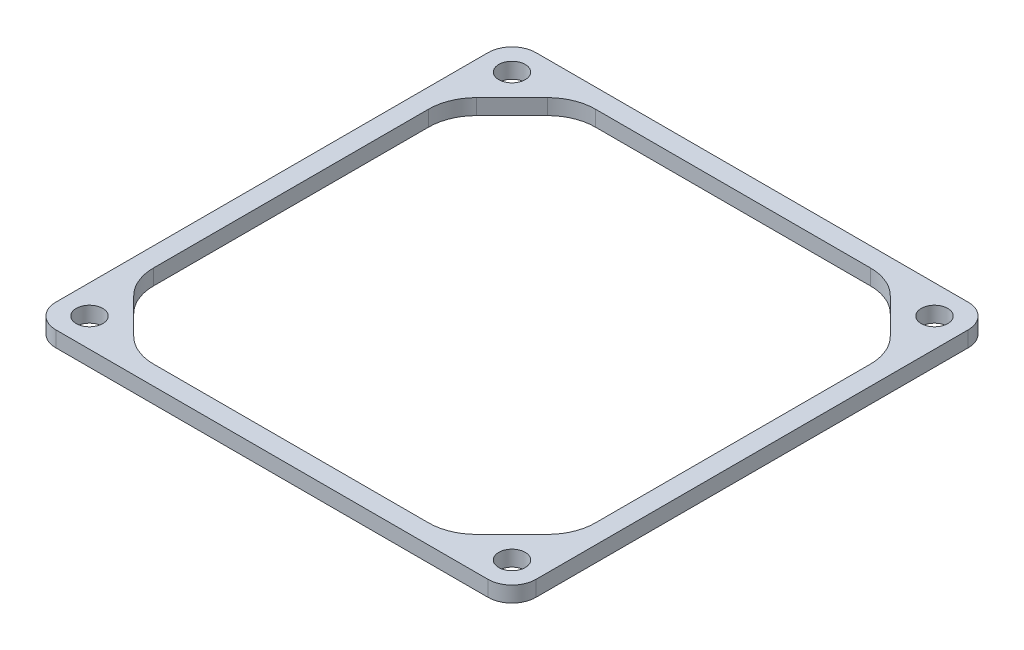
ISO-10303-21;
HEADER;
FILE_DESCRIPTION(('STEP AP214'),'2;1');
FILE_NAME('part.step','',(''),(''),'','','');
FILE_SCHEMA(('AUTOMOTIVE_DESIGN { 1 0 10303 214 1 1 1 1 }'));
ENDSEC;
DATA;
#1=APPLICATION_CONTEXT('core data for automotive mechanical design processes');
#2=APPLICATION_PROTOCOL_DEFINITION('international standard','automotive_design',2000,#1);
#3=PRODUCT_CONTEXT('',#1,'mechanical');
#4=PRODUCT('Part','Part','',(#3));
#5=PRODUCT_RELATED_PRODUCT_CATEGORY('part','',(#4));
#6=PRODUCT_DEFINITION_FORMATION('','',#4);
#7=PRODUCT_DEFINITION_CONTEXT('part definition',#1,'design');
#8=PRODUCT_DEFINITION('design','',#6,#7);
#9=PRODUCT_DEFINITION_SHAPE('','',#8);
#10=(LENGTH_UNIT() NAMED_UNIT(*) SI_UNIT(.MILLI.,.METRE.));
#11=(NAMED_UNIT(*) PLANE_ANGLE_UNIT() SI_UNIT($,.RADIAN.));
#12=(NAMED_UNIT(*) SI_UNIT($,.STERADIAN.) SOLID_ANGLE_UNIT());
#13=UNCERTAINTY_MEASURE_WITH_UNIT(LENGTH_MEASURE(1.E-05),#10,'distance_accuracy_value','');
#14=(GEOMETRIC_REPRESENTATION_CONTEXT(3) GLOBAL_UNCERTAINTY_ASSIGNED_CONTEXT((#13)) GLOBAL_UNIT_ASSIGNED_CONTEXT((#10,
#11,#12)) REPRESENTATION_CONTEXT('',''));
#15=CARTESIAN_POINT('',(0.,0.,0.));
#16=DIRECTION('',(0.,0.,1.));
#17=DIRECTION('',(1.,0.,0.));
#18=AXIS2_PLACEMENT_3D('',#15,#16,#17);
#19=CARTESIAN_POINT('',(-57.15,3.175,57.15));
#20=DIRECTION('',(0.,-1.,0.));
#21=DIRECTION('',(0.,0.,-1.));
#22=AXIS2_PLACEMENT_3D('',#19,#20,#21);
#23=CYLINDRICAL_SURFACE('',#22,6.35);
#24=CARTESIAN_POINT('',(-57.15,24.4475,57.15));
#25=DIRECTION('',(0.,-1.,0.));
#26=DIRECTION('',(0.,0.,-1.));
#27=AXIS2_PLACEMENT_3D('',#24,#25,#26);
#28=CIRCLE('',#27,6.35);
#29=CARTESIAN_POINT('',(-57.15,24.4475,63.5));
#30=VERTEX_POINT('',#29);
#31=CARTESIAN_POINT('',(-63.5,24.4475,57.15));
#32=VERTEX_POINT('',#31);
#33=EDGE_CURVE('E50',#30,#32,#28,.T.);
#34=ORIENTED_EDGE('',*,*,#33,.F.);
#35=DIRECTION('',(0.,-1.,0.));
#36=VECTOR('',#35,1.);
#37=CARTESIAN_POINT('',(-57.15,3.175,63.5));
#38=LINE('',#37,#36);
#39=CARTESIAN_POINT('',(-57.15,28.575,63.5));
#40=VERTEX_POINT('',#39);
#41=EDGE_CURVE('E11',#40,#30,#38,.T.);
#42=ORIENTED_EDGE('',*,*,#41,.F.);
#43=CARTESIAN_POINT('',(-57.15,28.575,57.15));
#44=DIRECTION('',(0.,1.,0.));
#45=DIRECTION('',(0.,0.,1.));
#46=AXIS2_PLACEMENT_3D('',#43,#44,#45);
#47=CIRCLE('',#46,6.35);
#48=CARTESIAN_POINT('',(-63.5,28.575,57.15));
#49=VERTEX_POINT('',#48);
#50=EDGE_CURVE('E264',#49,#40,#47,.T.);
#51=ORIENTED_EDGE('',*,*,#50,.F.);
#52=DIRECTION('',(0.,-1.,0.));
#53=VECTOR('',#52,1.);
#54=CARTESIAN_POINT('',(-63.5,3.175,57.15));
#55=LINE('',#54,#53);
#56=EDGE_CURVE('E288',#49,#32,#55,.T.);
#57=ORIENTED_EDGE('',*,*,#56,.T.);
#58=EDGE_LOOP('',(#34,#42,#51,#57));
#59=FACE_BOUND('',#58,.T.);
#60=ADVANCED_FACE('F35',(#59),#23,.T.);
#61=CARTESIAN_POINT('',(-57.15,3.175,63.5));
#62=DIRECTION('',(0.,0.,-1.));
#63=DIRECTION('',(-1.,0.,0.));
#64=AXIS2_PLACEMENT_3D('',#61,#62,#63);
#65=PLANE('',#64);
#66=DIRECTION('',(-1.,0.,0.));
#67=VECTOR('',#66,1.);
#68=CARTESIAN_POINT('',(-57.15,24.4475,63.5));
#69=LINE('',#68,#67);
#70=CARTESIAN_POINT('',(57.15,24.4475,63.5));
#71=VERTEX_POINT('',#70);
#72=EDGE_CURVE('E316',#71,#30,#69,.T.);
#73=ORIENTED_EDGE('',*,*,#72,.F.);
#74=DIRECTION('',(0.,-1.,0.));
#75=VECTOR('',#74,1.);
#76=CARTESIAN_POINT('',(57.15,3.175,63.5));
#77=LINE('',#76,#75);
#78=CARTESIAN_POINT('',(57.15,28.575,63.5));
#79=VERTEX_POINT('',#78);
#80=EDGE_CURVE('E43',#79,#71,#77,.T.);
#81=ORIENTED_EDGE('',*,*,#80,.F.);
#82=DIRECTION('',(1.,0.,0.));
#83=VECTOR('',#82,1.);
#84=CARTESIAN_POINT('',(-57.15,28.575,63.5));
#85=LINE('',#84,#83);
#86=EDGE_CURVE('E267',#40,#79,#85,.T.);
#87=ORIENTED_EDGE('',*,*,#86,.F.);
#88=ORIENTED_EDGE('',*,*,#41,.T.);
#89=EDGE_LOOP('',(#73,#81,#87,#88));
#90=FACE_BOUND('',#89,.T.);
#91=ADVANCED_FACE('F315',(#90),#65,.F.);
#92=CARTESIAN_POINT('',(57.15,3.175,57.15));
#93=DIRECTION('',(0.,-1.,0.));
#94=DIRECTION('',(0.,0.,-1.));
#95=AXIS2_PLACEMENT_3D('',#92,#93,#94);
#96=CYLINDRICAL_SURFACE('',#95,6.35);
#97=CARTESIAN_POINT('',(57.15,24.4475,57.15));
#98=DIRECTION('',(0.,-1.,0.));
#99=DIRECTION('',(0.,0.,-1.));
#100=AXIS2_PLACEMENT_3D('',#97,#98,#99);
#101=CIRCLE('',#100,6.35);
#102=CARTESIAN_POINT('',(63.5,24.4475,57.15));
#103=VERTEX_POINT('',#102);
#104=EDGE_CURVE('E311',#103,#71,#101,.T.);
#105=ORIENTED_EDGE('',*,*,#104,.F.);
#106=DIRECTION('',(0.,-1.,0.));
#107=VECTOR('',#106,1.);
#108=CARTESIAN_POINT('',(63.5,3.175,57.15));
#109=LINE('',#108,#107);
#110=CARTESIAN_POINT('',(63.5,28.575,57.15));
#111=VERTEX_POINT('',#110);
#112=EDGE_CURVE('E303',#111,#103,#109,.T.);
#113=ORIENTED_EDGE('',*,*,#112,.F.);
#114=CARTESIAN_POINT('',(57.15,28.575,57.15));
#115=DIRECTION('',(0.,1.,0.));
#116=DIRECTION('',(0.,0.,1.));
#117=AXIS2_PLACEMENT_3D('',#114,#115,#116);
#118=CIRCLE('',#117,6.35);
#119=EDGE_CURVE('E270',#79,#111,#118,.T.);
#120=ORIENTED_EDGE('',*,*,#119,.F.);
#121=ORIENTED_EDGE('',*,*,#80,.T.);
#122=EDGE_LOOP('',(#105,#113,#120,#121));
#123=FACE_BOUND('',#122,.T.);
#124=ADVANCED_FACE('F310',(#123),#96,.T.);
#125=CARTESIAN_POINT('',(63.5,3.175,-57.15));
#126=DIRECTION('',(-1.,0.,0.));
#127=DIRECTION('',(0.,0.,1.));
#128=AXIS2_PLACEMENT_3D('',#125,#126,#127);
#129=PLANE('',#128);
#130=DIRECTION('',(0.,0.,1.));
#131=VECTOR('',#130,1.);
#132=CARTESIAN_POINT('',(63.5,24.4475,-57.15));
#133=LINE('',#132,#131);
#134=CARTESIAN_POINT('',(63.5,24.4475,-57.15));
#135=VERTEX_POINT('',#134);
#136=EDGE_CURVE('E392',#135,#103,#133,.T.);
#137=ORIENTED_EDGE('',*,*,#136,.F.);
#138=DIRECTION('',(0.,-1.,0.));
#139=VECTOR('',#138,1.);
#140=CARTESIAN_POINT('',(63.5,3.175,-57.15));
#141=LINE('',#140,#139);
#142=CARTESIAN_POINT('',(63.5,28.575,-57.15));
#143=VERTEX_POINT('',#142);
#144=EDGE_CURVE('E300',#143,#135,#141,.T.);
#145=ORIENTED_EDGE('',*,*,#144,.F.);
#146=DIRECTION('',(0.,0.,-1.));
#147=VECTOR('',#146,1.);
#148=CARTESIAN_POINT('',(63.5,28.575,57.15));
#149=LINE('',#148,#147);
#150=EDGE_CURVE('E273',#111,#143,#149,.T.);
#151=ORIENTED_EDGE('',*,*,#150,.F.);
#152=ORIENTED_EDGE('',*,*,#112,.T.);
#153=EDGE_LOOP('',(#137,#145,#151,#152));
#154=FACE_BOUND('',#153,.T.);
#155=ADVANCED_FACE('F396',(#154),#129,.F.);
#156=CARTESIAN_POINT('',(57.15,3.175,-57.15));
#157=DIRECTION('',(0.,-1.,0.));
#158=DIRECTION('',(0.,0.,-1.));
#159=AXIS2_PLACEMENT_3D('',#156,#157,#158);
#160=CYLINDRICAL_SURFACE('',#159,6.35);
#161=CARTESIAN_POINT('',(57.15,24.4475,-57.15));
#162=DIRECTION('',(0.,-1.,0.));
#163=DIRECTION('',(0.,0.,-1.));
#164=AXIS2_PLACEMENT_3D('',#161,#162,#163);
#165=CIRCLE('',#164,6.35);
#166=CARTESIAN_POINT('',(57.15,24.4475,-63.5));
#167=VERTEX_POINT('',#166);
#168=EDGE_CURVE('E390',#167,#135,#165,.T.);
#169=ORIENTED_EDGE('',*,*,#168,.F.);
#170=DIRECTION('',(0.,-1.,0.));
#171=VECTOR('',#170,1.);
#172=CARTESIAN_POINT('',(57.15,3.175,-63.5));
#173=LINE('',#172,#171);
#174=CARTESIAN_POINT('',(57.15,28.575,-63.5));
#175=VERTEX_POINT('',#174);
#176=EDGE_CURVE('E297',#175,#167,#173,.T.);
#177=ORIENTED_EDGE('',*,*,#176,.F.);
#178=CARTESIAN_POINT('',(57.15,28.575,-57.15));
#179=DIRECTION('',(0.,1.,0.));
#180=DIRECTION('',(0.,0.,1.));
#181=AXIS2_PLACEMENT_3D('',#178,#179,#180);
#182=CIRCLE('',#181,6.35);
#183=EDGE_CURVE('E276',#143,#175,#182,.T.);
#184=ORIENTED_EDGE('',*,*,#183,.F.);
#185=ORIENTED_EDGE('',*,*,#144,.T.);
#186=EDGE_LOOP('',(#169,#177,#184,#185));
#187=FACE_BOUND('',#186,.T.);
#188=ADVANCED_FACE('F399',(#187),#160,.T.);
#189=CARTESIAN_POINT('',(-57.15,3.175,-63.5));
#190=DIRECTION('',(0.,0.,1.));
#191=DIRECTION('',(1.,0.,0.));
#192=AXIS2_PLACEMENT_3D('',#189,#190,#191);
#193=PLANE('',#192);
#194=DIRECTION('',(1.,0.,0.));
#195=VECTOR('',#194,1.);
#196=CARTESIAN_POINT('',(-57.15,24.4475,-63.5));
#197=LINE('',#196,#195);
#198=CARTESIAN_POINT('',(-57.15,24.4475,-63.5));
#199=VERTEX_POINT('',#198);
#200=EDGE_CURVE('E388',#199,#167,#197,.T.);
#201=ORIENTED_EDGE('',*,*,#200,.F.);
#202=DIRECTION('',(0.,-1.,0.));
#203=VECTOR('',#202,1.);
#204=CARTESIAN_POINT('',(-57.15,3.175,-63.5));
#205=LINE('',#204,#203);
#206=CARTESIAN_POINT('',(-57.15,28.575,-63.5));
#207=VERTEX_POINT('',#206);
#208=EDGE_CURVE('E294',#207,#199,#205,.T.);
#209=ORIENTED_EDGE('',*,*,#208,.F.);
#210=DIRECTION('',(-1.,0.,0.));
#211=VECTOR('',#210,1.);
#212=CARTESIAN_POINT('',(57.15,28.575,-63.5));
#213=LINE('',#212,#211);
#214=EDGE_CURVE('E279',#175,#207,#213,.T.);
#215=ORIENTED_EDGE('',*,*,#214,.F.);
#216=ORIENTED_EDGE('',*,*,#176,.T.);
#217=EDGE_LOOP('',(#201,#209,#215,#216));
#218=FACE_BOUND('',#217,.T.);
#219=ADVANCED_FACE('F404',(#218),#193,.F.);
#220=CARTESIAN_POINT('',(-57.15,3.175,-57.15));
#221=DIRECTION('',(0.,-1.,0.));
#222=DIRECTION('',(0.,0.,-1.));
#223=AXIS2_PLACEMENT_3D('',#220,#221,#222);
#224=CYLINDRICAL_SURFACE('',#223,6.35);
#225=CARTESIAN_POINT('',(-57.15,24.4475,-57.15));
#226=DIRECTION('',(0.,-1.,0.));
#227=DIRECTION('',(0.,0.,-1.));
#228=AXIS2_PLACEMENT_3D('',#225,#226,#227);
#229=CIRCLE('',#228,6.35);
#230=CARTESIAN_POINT('',(-63.5,24.4475,-57.15));
#231=VERTEX_POINT('',#230);
#232=EDGE_CURVE('E386',#231,#199,#229,.T.);
#233=ORIENTED_EDGE('',*,*,#232,.F.);
#234=DIRECTION('',(0.,-1.,0.));
#235=VECTOR('',#234,1.);
#236=CARTESIAN_POINT('',(-63.5,3.175,-57.15));
#237=LINE('',#236,#235);
#238=CARTESIAN_POINT('',(-63.5,28.575,-57.15));
#239=VERTEX_POINT('',#238);
#240=EDGE_CURVE('E291',#239,#231,#237,.T.);
#241=ORIENTED_EDGE('',*,*,#240,.F.);
#242=CARTESIAN_POINT('',(-57.15,28.575,-57.15));
#243=DIRECTION('',(0.,1.,0.));
#244=DIRECTION('',(0.,0.,1.));
#245=AXIS2_PLACEMENT_3D('',#242,#243,#244);
#246=CIRCLE('',#245,6.35);
#247=EDGE_CURVE('E282',#207,#239,#246,.T.);
#248=ORIENTED_EDGE('',*,*,#247,.F.);
#249=ORIENTED_EDGE('',*,*,#208,.T.);
#250=EDGE_LOOP('',(#233,#241,#248,#249));
#251=FACE_BOUND('',#250,.T.);
#252=ADVANCED_FACE('F407',(#251),#224,.T.);
#253=CARTESIAN_POINT('',(-63.5,3.175,-57.15));
#254=DIRECTION('',(1.,0.,0.));
#255=DIRECTION('',(0.,0.,-1.));
#256=AXIS2_PLACEMENT_3D('',#253,#254,#255);
#257=PLANE('',#256);
#258=DIRECTION('',(0.,0.,-1.));
#259=VECTOR('',#258,1.);
#260=CARTESIAN_POINT('',(-63.5,24.4475,-57.15));
#261=LINE('',#260,#259);
#262=EDGE_CURVE('E211',#32,#231,#261,.T.);
#263=ORIENTED_EDGE('',*,*,#262,.F.);
#264=ORIENTED_EDGE('',*,*,#56,.F.);
#265=DIRECTION('',(0.,0.,1.));
#266=VECTOR('',#265,1.);
#267=CARTESIAN_POINT('',(-63.5,28.575,-57.15));
#268=LINE('',#267,#266);
#269=EDGE_CURVE('E285',#239,#49,#268,.T.);
#270=ORIENTED_EDGE('',*,*,#269,.F.);
#271=ORIENTED_EDGE('',*,*,#240,.T.);
#272=EDGE_LOOP('',(#263,#264,#270,#271));
#273=FACE_BOUND('',#272,.T.);
#274=ADVANCED_FACE('F409',(#273),#257,.F.);
#275=CARTESIAN_POINT('',(36.3787193946549,28.575,-45.7200000000006));
#276=DIRECTION('',(0.,-1.,0.));
#277=DIRECTION('',(0.,0.,-1.));
#278=AXIS2_PLACEMENT_3D('',#275,#276,#277);
#279=CYLINDRICAL_SURFACE('',#278,12.7000000000065);
#280=DIRECTION('',(0.,-1.,0.));
#281=VECTOR('',#280,1.);
#282=CARTESIAN_POINT('',(36.3787193946544,28.575,-58.4200000000091));
#283=LINE('',#282,#281);
#284=CARTESIAN_POINT('',(36.3787193946544,28.575,-58.4200000000091));
#285=VERTEX_POINT('',#284);
#286=CARTESIAN_POINT('',(36.3787193946544,24.4475,-58.4200000000091));
#287=VERTEX_POINT('',#286);
#288=EDGE_CURVE('E210',#285,#287,#283,.T.);
#289=ORIENTED_EDGE('',*,*,#288,.T.);
#290=CARTESIAN_POINT('',(36.3787193946549,24.4475,-45.7200000000006));
#291=DIRECTION('',(0.,-1.,0.));
#292=DIRECTION('',(0.,0.,-1.));
#293=AXIS2_PLACEMENT_3D('',#290,#291,#292);
#294=CIRCLE('',#293,12.7000000000065);
#295=CARTESIAN_POINT('',(45.358975515728,24.4475,-54.7002561210722));
#296=VERTEX_POINT('',#295);
#297=EDGE_CURVE('E196',#287,#296,#294,.T.);
#298=ORIENTED_EDGE('',*,*,#297,.T.);
#299=DIRECTION('',(0.,-1.,0.));
#300=VECTOR('',#299,1.);
#301=CARTESIAN_POINT('',(45.358975515728,28.575,-54.7002561210722));
#302=LINE('',#301,#300);
#303=CARTESIAN_POINT('',(45.358975515728,28.575,-54.7002561210722));
#304=VERTEX_POINT('',#303);
#305=EDGE_CURVE('E207',#304,#296,#302,.T.);
#306=ORIENTED_EDGE('',*,*,#305,.F.);
#307=CARTESIAN_POINT('',(36.3787193946549,28.575,-45.7200000000006));
#308=DIRECTION('',(0.,1.,0.));
#309=DIRECTION('',(0.,0.,-1.));
#310=AXIS2_PLACEMENT_3D('',#307,#308,#309);
#311=CIRCLE('',#310,12.7000000000065);
#312=EDGE_CURVE('E340',#304,#285,#311,.T.);
#313=ORIENTED_EDGE('',*,*,#312,.T.);
#314=EDGE_LOOP('',(#289,#298,#306,#313));
#315=FACE_BOUND('',#314,.T.);
#316=ADVANCED_FACE('F206',(#315),#279,.F.);
#317=CARTESIAN_POINT('',(-36.3787193946537,28.575,-58.420000000006));
#318=DIRECTION('',(0.,0.,1.));
#319=DIRECTION('',(1.,0.,0.));
#320=AXIS2_PLACEMENT_3D('',#317,#318,#319);
#321=PLANE('',#320);
#322=DIRECTION('',(0.,-1.,0.));
#323=VECTOR('',#322,1.);
#324=CARTESIAN_POINT('',(-36.3787193946537,28.575,-58.420000000006));
#325=LINE('',#324,#323);
#326=CARTESIAN_POINT('',(-36.3787193946537,28.575,-58.420000000006));
#327=VERTEX_POINT('',#326);
#328=CARTESIAN_POINT('',(-36.3787193946529,24.4475,-58.420000000006));
#329=VERTEX_POINT('',#328);
#330=EDGE_CURVE('E260',#327,#329,#325,.T.);
#331=ORIENTED_EDGE('',*,*,#330,.T.);
#332=DIRECTION('',(1.,0.,0.));
#333=VECTOR('',#332,1.);
#334=CARTESIAN_POINT('',(-36.3787193946537,24.4475,-58.420000000006));
#335=LINE('',#334,#333);
#336=EDGE_CURVE('E212',#329,#287,#335,.T.);
#337=ORIENTED_EDGE('',*,*,#336,.T.);
#338=ORIENTED_EDGE('',*,*,#288,.F.);
#339=DIRECTION('',(-1.,0.,0.));
#340=VECTOR('',#339,1.);
#341=CARTESIAN_POINT('',(-36.3787193946537,28.575,-58.420000000006));
#342=LINE('',#341,#340);
#343=EDGE_CURVE('E342',#285,#327,#342,.T.);
#344=ORIENTED_EDGE('',*,*,#343,.T.);
#345=EDGE_LOOP('',(#331,#337,#338,#344));
#346=FACE_BOUND('',#345,.T.);
#347=ADVANCED_FACE('F376',(#346),#321,.T.);
#348=CARTESIAN_POINT('',(-36.3787193946529,28.575,-45.7200000000003));
#349=DIRECTION('',(0.,-1.,0.));
#350=DIRECTION('',(0.,0.,-1.));
#351=AXIS2_PLACEMENT_3D('',#348,#349,#350);
#352=CYLINDRICAL_SURFACE('',#351,12.7000000000057);
#353=DIRECTION('',(0.,-1.,0.));
#354=VECTOR('',#353,1.);
#355=CARTESIAN_POINT('',(-45.3589755157258,28.575,-54.7002561210737));
#356=LINE('',#355,#354);
#357=CARTESIAN_POINT('',(-45.3589755157258,28.575,-54.7002561210737));
#358=VERTEX_POINT('',#357);
#359=CARTESIAN_POINT('',(-45.3589755157258,24.4475,-54.7002561210737));
#360=VERTEX_POINT('',#359);
#361=EDGE_CURVE('E257',#358,#360,#356,.T.);
#362=ORIENTED_EDGE('',*,*,#361,.T.);
#363=CARTESIAN_POINT('',(-36.3787193946529,24.4475,-45.7200000000003));
#364=DIRECTION('',(0.,-1.,0.));
#365=DIRECTION('',(0.,0.,-1.));
#366=AXIS2_PLACEMENT_3D('',#363,#364,#365);
#367=CIRCLE('',#366,12.7000000000057);
#368=EDGE_CURVE('E379',#360,#329,#367,.T.);
#369=ORIENTED_EDGE('',*,*,#368,.T.);
#370=ORIENTED_EDGE('',*,*,#330,.F.);
#371=CARTESIAN_POINT('',(-36.3787193946529,28.575,-45.7200000000003));
#372=DIRECTION('',(0.,1.,0.));
#373=DIRECTION('',(0.,0.,1.));
#374=AXIS2_PLACEMENT_3D('',#371,#372,#373);
#375=CIRCLE('',#374,12.7000000000057);
#376=EDGE_CURVE('E344',#327,#358,#375,.T.);
#377=ORIENTED_EDGE('',*,*,#376,.T.);
#378=EDGE_LOOP('',(#362,#369,#370,#377));
#379=FACE_BOUND('',#378,.T.);
#380=ADVANCED_FACE('F463',(#379),#352,.F.);
#381=CARTESIAN_POINT('',(-54.7002561210715,28.575,-45.358975515728));
#382=DIRECTION('',(0.707106781186547,0.,0.707106781186548));
#383=DIRECTION('',(0.707106781186548,0.,-0.707106781186547));
#384=AXIS2_PLACEMENT_3D('',#381,#382,#383);
#385=PLANE('',#384);
#386=DIRECTION('',(0.,-1.,0.));
#387=VECTOR('',#386,1.);
#388=CARTESIAN_POINT('',(-54.7002561210715,28.575,-45.358975515728));
#389=LINE('',#388,#387);
#390=CARTESIAN_POINT('',(-54.7002561210715,28.575,-45.358975515728));
#391=VERTEX_POINT('',#390);
#392=CARTESIAN_POINT('',(-54.7002561210731,24.4475,-45.3589755157296));
#393=VERTEX_POINT('',#392);
#394=EDGE_CURVE('E254',#391,#393,#389,.T.);
#395=ORIENTED_EDGE('',*,*,#394,.T.);
#396=DIRECTION('',(0.707106781186548,0.,-0.707106781186547));
#397=VECTOR('',#396,1.);
#398=CARTESIAN_POINT('',(-54.7002561210715,24.4475,-45.358975515728));
#399=LINE('',#398,#397);
#400=EDGE_CURVE('E381',#393,#360,#399,.T.);
#401=ORIENTED_EDGE('',*,*,#400,.T.);
#402=ORIENTED_EDGE('',*,*,#361,.F.);
#403=DIRECTION('',(-0.707106781186548,0.,0.707106781186547));
#404=VECTOR('',#403,1.);
#405=CARTESIAN_POINT('',(-54.7002561210715,28.575,-45.358975515728));
#406=LINE('',#405,#404);
#407=EDGE_CURVE('E346',#358,#391,#406,.T.);
#408=ORIENTED_EDGE('',*,*,#407,.T.);
#409=EDGE_LOOP('',(#395,#401,#402,#408));
#410=FACE_BOUND('',#409,.T.);
#411=ADVANCED_FACE('F472',(#410),#385,.T.);
#412=CARTESIAN_POINT('',(-45.7199999999987,28.575,-36.3787193946548));
#413=DIRECTION('',(0.,-1.,0.));
#414=DIRECTION('',(0.,0.,-1.));
#415=AXIS2_PLACEMENT_3D('',#412,#413,#414);
#416=CYLINDRICAL_SURFACE('',#415,12.7000000000076);
#417=DIRECTION('',(0.,-1.,0.));
#418=VECTOR('',#417,1.);
#419=CARTESIAN_POINT('',(-58.4200000000063,28.575,-36.3787193946547));
#420=LINE('',#419,#418);
#421=CARTESIAN_POINT('',(-58.4200000000063,28.575,-36.3787193946547));
#422=VERTEX_POINT('',#421);
#423=CARTESIAN_POINT('',(-58.4200000000085,24.4475,-36.3787193946547));
#424=VERTEX_POINT('',#423);
#425=EDGE_CURVE('E251',#422,#424,#420,.T.);
#426=ORIENTED_EDGE('',*,*,#425,.T.);
#427=CARTESIAN_POINT('',(-45.7199999999987,24.4475,-36.3787193946548));
#428=DIRECTION('',(0.,-1.,0.));
#429=DIRECTION('',(0.,0.,-1.));
#430=AXIS2_PLACEMENT_3D('',#427,#428,#429);
#431=CIRCLE('',#430,12.7000000000076);
#432=EDGE_CURVE('E747',#424,#393,#431,.T.);
#433=ORIENTED_EDGE('',*,*,#432,.T.);
#434=ORIENTED_EDGE('',*,*,#394,.F.);
#435=CARTESIAN_POINT('',(-45.7199999999987,28.575,-36.3787193946548));
#436=DIRECTION('',(0.,1.,0.));
#437=DIRECTION('',(0.,0.,-1.));
#438=AXIS2_PLACEMENT_3D('',#435,#436,#437);
#439=CIRCLE('',#438,12.7000000000076);
#440=EDGE_CURVE('E348',#391,#422,#439,.T.);
#441=ORIENTED_EDGE('',*,*,#440,.T.);
#442=EDGE_LOOP('',(#426,#433,#434,#441));
#443=FACE_BOUND('',#442,.T.);
#444=ADVANCED_FACE('F482',(#443),#416,.F.);
#445=CARTESIAN_POINT('',(-58.4200000000043,28.575,36.3787193946538));
#446=DIRECTION('',(1.,0.,0.));
#447=DIRECTION('',(0.,0.,-1.));
#448=AXIS2_PLACEMENT_3D('',#445,#446,#447);
#449=PLANE('',#448);
#450=DIRECTION('',(0.,-1.,0.));
#451=VECTOR('',#450,1.);
#452=CARTESIAN_POINT('',(-58.4200000000043,28.575,36.3787193946538));
#453=LINE('',#452,#451);
#454=CARTESIAN_POINT('',(-58.4200000000043,28.575,36.3787193946538));
#455=VERTEX_POINT('',#454);
#456=CARTESIAN_POINT('',(-58.4200000000054,24.4475,36.3787193946538));
#457=VERTEX_POINT('',#456);
#458=EDGE_CURVE('E248',#455,#457,#453,.T.);
#459=ORIENTED_EDGE('',*,*,#458,.T.);
#460=DIRECTION('',(0.,0.,-1.));
#461=VECTOR('',#460,1.);
#462=CARTESIAN_POINT('',(-58.4200000000043,24.4475,36.3787193946538));
#463=LINE('',#462,#461);
#464=EDGE_CURVE('E744',#457,#424,#463,.T.);
#465=ORIENTED_EDGE('',*,*,#464,.T.);
#466=ORIENTED_EDGE('',*,*,#425,.F.);
#467=DIRECTION('',(0.,0.,1.));
#468=VECTOR('',#467,1.);
#469=CARTESIAN_POINT('',(-58.4200000000043,28.575,36.3787193946538));
#470=LINE('',#469,#468);
#471=EDGE_CURVE('E350',#422,#455,#470,.T.);
#472=ORIENTED_EDGE('',*,*,#471,.T.);
#473=EDGE_LOOP('',(#459,#465,#466,#472));
#474=FACE_BOUND('',#473,.T.);
#475=ADVANCED_FACE('F492',(#474),#449,.T.);
#476=CARTESIAN_POINT('',(-45.7199999999994,28.575,36.378719394653));
#477=DIRECTION('',(0.,-1.,0.));
#478=DIRECTION('',(0.,0.,-1.));
#479=AXIS2_PLACEMENT_3D('',#476,#477,#478);
#480=CYLINDRICAL_SURFACE('',#479,12.700000000006);
#481=DIRECTION('',(0.,-1.,0.));
#482=VECTOR('',#481,1.);
#483=CARTESIAN_POINT('',(-54.7002561210721,28.575,45.3589755157271));
#484=LINE('',#483,#482);
#485=CARTESIAN_POINT('',(-54.7002561210721,28.575,45.3589755157271));
#486=VERTEX_POINT('',#485);
#487=CARTESIAN_POINT('',(-54.7002561210721,24.4475,45.3589755157286));
#488=VERTEX_POINT('',#487);
#489=EDGE_CURVE('E245',#486,#488,#484,.T.);
#490=ORIENTED_EDGE('',*,*,#489,.T.);
#491=CARTESIAN_POINT('',(-45.7199999999994,24.4475,36.378719394653));
#492=DIRECTION('',(0.,-1.,0.));
#493=DIRECTION('',(0.,0.,-1.));
#494=AXIS2_PLACEMENT_3D('',#491,#492,#493);
#495=CIRCLE('',#494,12.700000000006);
#496=EDGE_CURVE('E741',#488,#457,#495,.T.);
#497=ORIENTED_EDGE('',*,*,#496,.T.);
#498=ORIENTED_EDGE('',*,*,#458,.F.);
#499=CARTESIAN_POINT('',(-45.7199999999994,28.575,36.378719394653));
#500=DIRECTION('',(0.,1.,0.));
#501=DIRECTION('',(0.,0.,1.));
#502=AXIS2_PLACEMENT_3D('',#499,#500,#501);
#503=CIRCLE('',#502,12.700000000006);
#504=EDGE_CURVE('E352',#455,#486,#503,.T.);
#505=ORIENTED_EDGE('',*,*,#504,.T.);
#506=EDGE_LOOP('',(#490,#497,#498,#505));
#507=FACE_BOUND('',#506,.T.);
#508=ADVANCED_FACE('F502',(#507),#480,.F.);
#509=CARTESIAN_POINT('',(-45.3589755157256,28.575,54.7002561210736));
#510=DIRECTION('',(0.707106781186492,0.,-0.707106781186603));
#511=DIRECTION('',(-0.707106781186603,0.,-0.707106781186492));
#512=AXIS2_PLACEMENT_3D('',#509,#510,#511);
#513=PLANE('',#512);
#514=DIRECTION('',(0.,-1.,0.));
#515=VECTOR('',#514,1.);
#516=CARTESIAN_POINT('',(-45.3589755157256,28.575,54.7002561210736));
#517=LINE('',#516,#515);
#518=CARTESIAN_POINT('',(-45.3589755157256,28.575,54.7002561210736));
#519=VERTEX_POINT('',#518);
#520=CARTESIAN_POINT('',(-45.3589755157254,24.4475,54.7002561210734));
#521=VERTEX_POINT('',#520);
#522=EDGE_CURVE('E242',#519,#521,#517,.T.);
#523=ORIENTED_EDGE('',*,*,#522,.T.);
#524=DIRECTION('',(-0.707106781186603,0.,-0.707106781186492));
#525=VECTOR('',#524,1.);
#526=CARTESIAN_POINT('',(-45.3589755157256,24.4475,54.7002561210736));
#527=LINE('',#526,#525);
#528=EDGE_CURVE('E738',#521,#488,#527,.T.);
#529=ORIENTED_EDGE('',*,*,#528,.T.);
#530=ORIENTED_EDGE('',*,*,#489,.F.);
#531=DIRECTION('',(0.707106781186603,0.,0.707106781186492));
#532=VECTOR('',#531,1.);
#533=CARTESIAN_POINT('',(-45.3589755157256,28.575,54.7002561210736));
#534=LINE('',#533,#532);
#535=EDGE_CURVE('E354',#486,#519,#534,.T.);
#536=ORIENTED_EDGE('',*,*,#535,.T.);
#537=EDGE_LOOP('',(#523,#529,#530,#536));
#538=FACE_BOUND('',#537,.T.);
#539=ADVANCED_FACE('F512',(#538),#513,.T.);
#540=CARTESIAN_POINT('',(-36.378719394653,28.575,45.7199999999995));
#541=DIRECTION('',(0.,-1.,0.));
#542=DIRECTION('',(0.,0.,-1.));
#543=AXIS2_PLACEMENT_3D('',#540,#541,#542);
#544=CYLINDRICAL_SURFACE('',#543,12.7000000000056);
#545=DIRECTION('',(0.,-1.,0.));
#546=VECTOR('',#545,1.);
#547=CARTESIAN_POINT('',(-36.378719394653,28.575,58.4200000000052));
#548=LINE('',#547,#546);
#549=CARTESIAN_POINT('',(-36.378719394653,28.575,58.4200000000052));
#550=VERTEX_POINT('',#549);
#551=CARTESIAN_POINT('',(-36.378719394653,24.4475,58.4200000000049));
#552=VERTEX_POINT('',#551);
#553=EDGE_CURVE('E239',#550,#552,#548,.T.);
#554=ORIENTED_EDGE('',*,*,#553,.T.);
#555=CARTESIAN_POINT('',(-36.378719394653,24.4475,45.7199999999995));
#556=DIRECTION('',(0.,-1.,0.));
#557=DIRECTION('',(0.,0.,-1.));
#558=AXIS2_PLACEMENT_3D('',#555,#556,#557);
#559=CIRCLE('',#558,12.7000000000056);
#560=EDGE_CURVE('E735',#552,#521,#559,.T.);
#561=ORIENTED_EDGE('',*,*,#560,.T.);
#562=ORIENTED_EDGE('',*,*,#522,.F.);
#563=CARTESIAN_POINT('',(-36.378719394653,28.575,45.7199999999995));
#564=DIRECTION('',(0.,1.,0.));
#565=DIRECTION('',(0.,0.,-1.));
#566=AXIS2_PLACEMENT_3D('',#563,#564,#565);
#567=CIRCLE('',#566,12.7000000000056);
#568=EDGE_CURVE('E356',#519,#550,#567,.T.);
#569=ORIENTED_EDGE('',*,*,#568,.T.);
#570=EDGE_LOOP('',(#554,#561,#562,#569));
#571=FACE_BOUND('',#570,.T.);
#572=ADVANCED_FACE('F522',(#571),#544,.F.);
#573=CARTESIAN_POINT('',(-36.378719394653,28.575,58.4200000000049));
#574=DIRECTION('',(0.,0.,-1.));
#575=DIRECTION('',(-1.,0.,0.));
#576=AXIS2_PLACEMENT_3D('',#573,#574,#575);
#577=PLANE('',#576);
#578=DIRECTION('',(0.,-1.,0.));
#579=VECTOR('',#578,1.);
#580=CARTESIAN_POINT('',(36.3787193946556,28.575,58.4200000000049));
#581=LINE('',#580,#579);
#582=CARTESIAN_POINT('',(36.3787193946556,28.575,58.4200000000049));
#583=VERTEX_POINT('',#582);
#584=CARTESIAN_POINT('',(36.3787193946556,24.4475,58.420000000005));
#585=VERTEX_POINT('',#584);
#586=EDGE_CURVE('E236',#583,#585,#581,.T.);
#587=ORIENTED_EDGE('',*,*,#586,.T.);
#588=DIRECTION('',(-1.,0.,0.));
#589=VECTOR('',#588,1.);
#590=CARTESIAN_POINT('',(-36.378719394653,24.4475,58.4200000000049));
#591=LINE('',#590,#589);
#592=EDGE_CURVE('E732',#585,#552,#591,.T.);
#593=ORIENTED_EDGE('',*,*,#592,.T.);
#594=ORIENTED_EDGE('',*,*,#553,.F.);
#595=DIRECTION('',(1.,0.,0.));
#596=VECTOR('',#595,1.);
#597=CARTESIAN_POINT('',(-36.378719394653,28.575,58.4200000000049));
#598=LINE('',#597,#596);
#599=EDGE_CURVE('E358',#550,#583,#598,.T.);
#600=ORIENTED_EDGE('',*,*,#599,.T.);
#601=EDGE_LOOP('',(#587,#593,#594,#600));
#602=FACE_BOUND('',#601,.T.);
#603=ADVANCED_FACE('F532',(#602),#577,.T.);
#604=CARTESIAN_POINT('',(36.3787193946556,28.575,45.72));
#605=DIRECTION('',(0.,-1.,0.));
#606=DIRECTION('',(0.,0.,-1.));
#607=AXIS2_PLACEMENT_3D('',#604,#605,#606);
#608=CYLINDRICAL_SURFACE('',#607,12.700000000005);
#609=DIRECTION('',(0.,-1.,0.));
#610=VECTOR('',#609,1.);
#611=CARTESIAN_POINT('',(45.3589755157277,28.575,54.7002561210733));
#612=LINE('',#611,#610);
#613=CARTESIAN_POINT('',(45.3589755157277,28.575,54.7002561210733));
#614=VERTEX_POINT('',#613);
#615=CARTESIAN_POINT('',(45.3589755157278,24.4475,54.7002561210733));
#616=VERTEX_POINT('',#615);
#617=EDGE_CURVE('E233',#614,#616,#612,.T.);
#618=ORIENTED_EDGE('',*,*,#617,.T.);
#619=CARTESIAN_POINT('',(36.3787193946556,24.4475,45.72));
#620=DIRECTION('',(0.,-1.,0.));
#621=DIRECTION('',(0.,0.,-1.));
#622=AXIS2_PLACEMENT_3D('',#619,#620,#621);
#623=CIRCLE('',#622,12.700000000005);
#624=EDGE_CURVE('E729',#616,#585,#623,.T.);
#625=ORIENTED_EDGE('',*,*,#624,.T.);
#626=ORIENTED_EDGE('',*,*,#586,.F.);
#627=CARTESIAN_POINT('',(36.3787193946556,28.575,45.72));
#628=DIRECTION('',(0.,1.,0.));
#629=DIRECTION('',(0.,0.,1.));
#630=AXIS2_PLACEMENT_3D('',#627,#628,#629);
#631=CIRCLE('',#630,12.700000000005);
#632=EDGE_CURVE('E360',#583,#614,#631,.T.);
#633=ORIENTED_EDGE('',*,*,#632,.T.);
#634=EDGE_LOOP('',(#618,#625,#626,#633));
#635=FACE_BOUND('',#634,.T.);
#636=ADVANCED_FACE('F542',(#635),#608,.F.);
#637=CARTESIAN_POINT('',(54.700256121075,28.575,45.3589755157261));
#638=DIRECTION('',(-0.707106781186546,0.,-0.707106781186549));
#639=DIRECTION('',(-0.707106781186549,0.,0.707106781186546));
#640=AXIS2_PLACEMENT_3D('',#637,#638,#639);
#641=PLANE('',#640);
#642=DIRECTION('',(0.,-1.,0.));
#643=VECTOR('',#642,1.);
#644=CARTESIAN_POINT('',(54.700256121075,28.575,45.3589755157261));
#645=LINE('',#644,#643);
#646=CARTESIAN_POINT('',(54.700256121075,28.575,45.3589755157261));
#647=VERTEX_POINT('',#646);
#648=CARTESIAN_POINT('',(54.7002561210751,24.4475,45.3589755157262));
#649=VERTEX_POINT('',#648);
#650=EDGE_CURVE('E230',#647,#649,#645,.T.);
#651=ORIENTED_EDGE('',*,*,#650,.T.);
#652=DIRECTION('',(-0.707106781186549,0.,0.707106781186546));
#653=VECTOR('',#652,1.);
#654=CARTESIAN_POINT('',(54.700256121075,24.4475,45.3589755157261));
#655=LINE('',#654,#653);
#656=EDGE_CURVE('E726',#649,#616,#655,.T.);
#657=ORIENTED_EDGE('',*,*,#656,.T.);
#658=ORIENTED_EDGE('',*,*,#617,.F.);
#659=DIRECTION('',(0.707106781186549,0.,-0.707106781186546));
#660=VECTOR('',#659,1.);
#661=CARTESIAN_POINT('',(54.700256121075,28.575,45.3589755157261));
#662=LINE('',#661,#660);
#663=EDGE_CURVE('E362',#614,#647,#662,.T.);
#664=ORIENTED_EDGE('',*,*,#663,.T.);
#665=EDGE_LOOP('',(#651,#657,#658,#664));
#666=FACE_BOUND('',#665,.T.);
#667=ADVANCED_FACE('F552',(#666),#641,.T.);
#668=CARTESIAN_POINT('',(45.7200000000029,28.575,36.3787193946528));
#669=DIRECTION('',(0.,-1.,0.));
#670=DIRECTION('',(0.,0.,-1.));
#671=AXIS2_PLACEMENT_3D('',#668,#669,#670);
#672=CYLINDRICAL_SURFACE('',#671,12.7000000000052);
#673=DIRECTION('',(0.,-1.,0.));
#674=VECTOR('',#673,1.);
#675=CARTESIAN_POINT('',(58.4200000000081,28.575,36.3787193946527));
#676=LINE('',#675,#674);
#677=CARTESIAN_POINT('',(58.4200000000081,28.575,36.3787193946527));
#678=VERTEX_POINT('',#677);
#679=CARTESIAN_POINT('',(58.4200000000082,24.4475,36.3787193946527));
#680=VERTEX_POINT('',#679);
#681=EDGE_CURVE('E227',#678,#680,#676,.T.);
#682=ORIENTED_EDGE('',*,*,#681,.T.);
#683=CARTESIAN_POINT('',(45.7200000000029,24.4475,36.3787193946528));
#684=DIRECTION('',(0.,-1.,0.));
#685=DIRECTION('',(0.,0.,-1.));
#686=AXIS2_PLACEMENT_3D('',#683,#684,#685);
#687=CIRCLE('',#686,12.7000000000052);
#688=EDGE_CURVE('E723',#680,#649,#687,.T.);
#689=ORIENTED_EDGE('',*,*,#688,.T.);
#690=ORIENTED_EDGE('',*,*,#650,.F.);
#691=CARTESIAN_POINT('',(45.7200000000029,28.575,36.3787193946528));
#692=DIRECTION('',(0.,1.,0.));
#693=DIRECTION('',(0.,0.,-1.));
#694=AXIS2_PLACEMENT_3D('',#691,#692,#693);
#695=CIRCLE('',#694,12.7000000000052);
#696=EDGE_CURVE('E364',#647,#678,#695,.T.);
#697=ORIENTED_EDGE('',*,*,#696,.T.);
#698=EDGE_LOOP('',(#682,#689,#690,#697));
#699=FACE_BOUND('',#698,.T.);
#700=ADVANCED_FACE('F562',(#699),#672,.F.);
#701=CARTESIAN_POINT('',(58.4200000000082,28.575,36.3787193946527));
#702=DIRECTION('',(-1.,0.,0.));
#703=DIRECTION('',(0.,0.,1.));
#704=AXIS2_PLACEMENT_3D('',#701,#702,#703);
#705=PLANE('',#704);
#706=DIRECTION('',(0.,-1.,0.));
#707=VECTOR('',#706,1.);
#708=CARTESIAN_POINT('',(58.4200000000082,28.575,-36.3787193946521));
#709=LINE('',#708,#707);
#710=CARTESIAN_POINT('',(58.4200000000082,28.575,-36.3787193946521));
#711=VERTEX_POINT('',#710);
#712=CARTESIAN_POINT('',(58.420000000008,24.4475,-36.3787193946521));
#713=VERTEX_POINT('',#712);
#714=EDGE_CURVE('E219',#711,#713,#709,.T.);
#715=ORIENTED_EDGE('',*,*,#714,.T.);
#716=DIRECTION('',(0.,0.,1.));
#717=VECTOR('',#716,1.);
#718=CARTESIAN_POINT('',(58.4200000000082,24.4475,36.3787193946527));
#719=LINE('',#718,#717);
#720=EDGE_CURVE('E720',#713,#680,#719,.T.);
#721=ORIENTED_EDGE('',*,*,#720,.T.);
#722=ORIENTED_EDGE('',*,*,#681,.F.);
#723=DIRECTION('',(0.,0.,-1.));
#724=VECTOR('',#723,1.);
#725=CARTESIAN_POINT('',(58.4200000000082,28.575,36.3787193946527));
#726=LINE('',#725,#724);
#727=EDGE_CURVE('E366',#678,#711,#726,.T.);
#728=ORIENTED_EDGE('',*,*,#727,.T.);
#729=EDGE_LOOP('',(#715,#721,#722,#728));
#730=FACE_BOUND('',#729,.T.);
#731=ADVANCED_FACE('F572',(#730),#705,.T.);
#732=CARTESIAN_POINT('',(45.7200000000033,28.575,-36.3787193946521));
#733=DIRECTION('',(0.,-1.,0.));
#734=DIRECTION('',(0.,0.,-1.));
#735=AXIS2_PLACEMENT_3D('',#732,#733,#734);
#736=CYLINDRICAL_SURFACE('',#735,12.7000000000047);
#737=DIRECTION('',(0.,-1.,0.));
#738=VECTOR('',#737,1.);
#739=CARTESIAN_POINT('',(54.7002561210759,28.575,-45.3589755157245));
#740=LINE('',#739,#738);
#741=CARTESIAN_POINT('',(54.7002561210756,28.575,-45.3589755157245));
#742=VERTEX_POINT('',#741);
#743=CARTESIAN_POINT('',(54.7002561210759,24.4475,-45.3589755157245));
#744=VERTEX_POINT('',#743);
#745=EDGE_CURVE('E217',#742,#744,#740,.T.);
#746=ORIENTED_EDGE('',*,*,#745,.T.);
#747=CARTESIAN_POINT('',(45.7200000000033,24.4475,-36.3787193946521));
#748=DIRECTION('',(0.,-1.,0.));
#749=DIRECTION('',(0.,0.,-1.));
#750=AXIS2_PLACEMENT_3D('',#747,#748,#749);
#751=CIRCLE('',#750,12.7000000000047);
#752=EDGE_CURVE('E58',#744,#713,#751,.T.);
#753=ORIENTED_EDGE('',*,*,#752,.T.);
#754=ORIENTED_EDGE('',*,*,#714,.F.);
#755=CARTESIAN_POINT('',(45.7200000000033,28.575,-36.3787193946521));
#756=DIRECTION('',(0.,1.,0.));
#757=DIRECTION('',(0.,0.,1.));
#758=AXIS2_PLACEMENT_3D('',#755,#756,#757);
#759=CIRCLE('',#758,12.7000000000047);
#760=EDGE_CURVE('E221',#711,#742,#759,.T.);
#761=ORIENTED_EDGE('',*,*,#760,.T.);
#762=EDGE_LOOP('',(#746,#753,#754,#761));
#763=FACE_BOUND('',#762,.T.);
#764=ADVANCED_FACE('F371',(#763),#736,.F.);
#765=CARTESIAN_POINT('',(45.358975515728,28.575,-54.7002561210722));
#766=DIRECTION('',(-0.707106781186552,0.,0.707106781186543));
#767=DIRECTION('',(0.707106781186543,0.,0.707106781186552));
#768=AXIS2_PLACEMENT_3D('',#765,#766,#767);
#769=PLANE('',#768);
#770=ORIENTED_EDGE('',*,*,#305,.T.);
#771=DIRECTION('',(0.707106781186543,0.,0.707106781186552));
#772=VECTOR('',#771,1.);
#773=CARTESIAN_POINT('',(45.358975515728,24.4475,-54.7002561210722));
#774=LINE('',#773,#772);
#775=EDGE_CURVE('E193',#296,#744,#774,.T.);
#776=ORIENTED_EDGE('',*,*,#775,.T.);
#777=ORIENTED_EDGE('',*,*,#745,.F.);
#778=DIRECTION('',(-0.707106781186543,0.,-0.707106781186552));
#779=VECTOR('',#778,1.);
#780=CARTESIAN_POINT('',(45.358975515728,28.575,-54.7002561210722));
#781=LINE('',#780,#779);
#782=EDGE_CURVE('E216',#742,#304,#781,.T.);
#783=ORIENTED_EDGE('',*,*,#782,.T.);
#784=EDGE_LOOP('',(#770,#776,#777,#783));
#785=FACE_BOUND('',#784,.T.);
#786=ADVANCED_FACE('F214',(#785),#769,.T.);
#787=CARTESIAN_POINT('',(55.88,0.,55.88));
#788=DIRECTION('',(0.,-1.,0.));
#789=DIRECTION('',(0.,0.,-1.));
#790=AXIS2_PLACEMENT_3D('',#787,#788,#789);
#791=CYLINDRICAL_SURFACE('',#790,3.50000000000001);
#792=CARTESIAN_POINT('',(55.88,28.575,55.88));
#793=DIRECTION('',(0.,-1.,0.));
#794=DIRECTION('',(0.,0.,-1.));
#795=AXIS2_PLACEMENT_3D('',#792,#793,#794);
#796=CIRCLE('',#795,3.50000000000001);
#797=CARTESIAN_POINT('',(55.88,28.575,52.38));
#798=VERTEX_POINT('',#797);
#799=EDGE_CURVE('E337',#798,#798,#796,.T.);
#800=ORIENTED_EDGE('',*,*,#799,.F.);
#801=EDGE_LOOP('',(#800));
#802=FACE_BOUND('',#801,.T.);
#803=CARTESIAN_POINT('',(55.88,24.4475,55.88));
#804=DIRECTION('',(0.,-1.,0.));
#805=DIRECTION('',(0.,0.,-1.));
#806=AXIS2_PLACEMENT_3D('',#803,#804,#805);
#807=CIRCLE('',#806,3.50000000000001);
#808=CARTESIAN_POINT('',(55.88,24.4475,52.38));
#809=VERTEX_POINT('',#808);
#810=EDGE_CURVE('E201',#809,#809,#807,.F.);
#811=ORIENTED_EDGE('',*,*,#810,.F.);
#812=EDGE_LOOP('',(#811));
#813=FACE_BOUND('',#812,.T.);
#814=ADVANCED_FACE('F599',(#802,#813),#791,.F.);
#815=CARTESIAN_POINT('',(-55.88,0.,55.88));
#816=DIRECTION('',(0.,-1.,0.));
#817=DIRECTION('',(0.,0.,-1.));
#818=AXIS2_PLACEMENT_3D('',#815,#816,#817);
#819=CYLINDRICAL_SURFACE('',#818,3.50000000000001);
#820=CARTESIAN_POINT('',(-55.88,28.575,55.88));
#821=DIRECTION('',(0.,-1.,0.));
#822=DIRECTION('',(0.,0.,-1.));
#823=AXIS2_PLACEMENT_3D('',#820,#821,#822);
#824=CIRCLE('',#823,3.50000000000001);
#825=CARTESIAN_POINT('',(-55.88,28.575,52.38));
#826=VERTEX_POINT('',#825);
#827=EDGE_CURVE('E334',#826,#826,#824,.T.);
#828=ORIENTED_EDGE('',*,*,#827,.F.);
#829=EDGE_LOOP('',(#828));
#830=FACE_BOUND('',#829,.T.);
#831=CARTESIAN_POINT('',(-55.88,24.4475,55.88));
#832=DIRECTION('',(0.,-1.,0.));
#833=DIRECTION('',(0.,0.,-1.));
#834=AXIS2_PLACEMENT_3D('',#831,#832,#833);
#835=CIRCLE('',#834,3.50000000000001);
#836=CARTESIAN_POINT('',(-55.88,24.4475,52.38));
#837=VERTEX_POINT('',#836);
#838=EDGE_CURVE('E712',#837,#837,#835,.F.);
#839=ORIENTED_EDGE('',*,*,#838,.F.);
#840=EDGE_LOOP('',(#839));
#841=FACE_BOUND('',#840,.T.);
#842=ADVANCED_FACE('F608',(#830,#841),#819,.F.);
#843=CARTESIAN_POINT('',(-55.88,0.,-55.88));
#844=DIRECTION('',(0.,-1.,0.));
#845=DIRECTION('',(0.,0.,-1.));
#846=AXIS2_PLACEMENT_3D('',#843,#844,#845);
#847=CYLINDRICAL_SURFACE('',#846,3.50000000000001);
#848=CARTESIAN_POINT('',(-55.88,28.575,-55.88));
#849=DIRECTION('',(0.,-1.,0.));
#850=DIRECTION('',(0.,0.,-1.));
#851=AXIS2_PLACEMENT_3D('',#848,#849,#850);
#852=CIRCLE('',#851,3.50000000000001);
#853=CARTESIAN_POINT('',(-55.88,28.575,-59.38));
#854=VERTEX_POINT('',#853);
#855=EDGE_CURVE('E327',#854,#854,#852,.T.);
#856=ORIENTED_EDGE('',*,*,#855,.F.);
#857=EDGE_LOOP('',(#856));
#858=FACE_BOUND('',#857,.T.);
#859=CARTESIAN_POINT('',(-55.88,24.4475,-55.88));
#860=DIRECTION('',(0.,-1.,0.));
#861=DIRECTION('',(0.,0.,-1.));
#862=AXIS2_PLACEMENT_3D('',#859,#860,#861);
#863=CIRCLE('',#862,3.50000000000001);
#864=CARTESIAN_POINT('',(-55.88,24.4475,-59.38));
#865=VERTEX_POINT('',#864);
#866=EDGE_CURVE('E715',#865,#865,#863,.F.);
#867=ORIENTED_EDGE('',*,*,#866,.F.);
#868=EDGE_LOOP('',(#867));
#869=FACE_BOUND('',#868,.T.);
#870=ADVANCED_FACE('F618',(#858,#869),#847,.F.);
#871=CARTESIAN_POINT('',(55.88,0.,-55.88));
#872=DIRECTION('',(0.,-1.,0.));
#873=DIRECTION('',(0.,0.,-1.));
#874=AXIS2_PLACEMENT_3D('',#871,#872,#873);
#875=CYLINDRICAL_SURFACE('',#874,3.50000000000001);
#876=CARTESIAN_POINT('',(55.88,28.575,-55.88));
#877=DIRECTION('',(0.,-1.,0.));
#878=DIRECTION('',(0.,0.,-1.));
#879=AXIS2_PLACEMENT_3D('',#876,#877,#878);
#880=CIRCLE('',#879,3.50000000000001);
#881=CARTESIAN_POINT('',(55.88,28.575,-59.38));
#882=VERTEX_POINT('',#881);
#883=EDGE_CURVE('E324',#882,#882,#880,.T.);
#884=ORIENTED_EDGE('',*,*,#883,.F.);
#885=EDGE_LOOP('',(#884));
#886=FACE_BOUND('',#885,.T.);
#887=CARTESIAN_POINT('',(55.88,24.4475,-55.88));
#888=DIRECTION('',(0.,-1.,0.));
#889=DIRECTION('',(0.,0.,-1.));
#890=AXIS2_PLACEMENT_3D('',#887,#888,#889);
#891=CIRCLE('',#890,3.50000000000001);
#892=CARTESIAN_POINT('',(55.88,24.4475,-59.38));
#893=VERTEX_POINT('',#892);
#894=EDGE_CURVE('E38',#893,#893,#891,.F.);
#895=ORIENTED_EDGE('',*,*,#894,.F.);
#896=EDGE_LOOP('',(#895));
#897=FACE_BOUND('',#896,.T.);
#898=ADVANCED_FACE('F628',(#886,#897),#875,.F.);
#899=CARTESIAN_POINT('',(-57.15,28.575,57.15));
#900=DIRECTION('',(0.,1.,0.));
#901=DIRECTION('',(0.,0.,1.));
#902=AXIS2_PLACEMENT_3D('',#899,#900,#901);
#903=PLANE('',#902);
#904=ORIENTED_EDGE('',*,*,#883,.T.);
#905=EDGE_LOOP('',(#904));
#906=FACE_BOUND('',#905,.T.);
#907=ORIENTED_EDGE('',*,*,#855,.T.);
#908=EDGE_LOOP('',(#907));
#909=FACE_BOUND('',#908,.T.);
#910=ORIENTED_EDGE('',*,*,#827,.T.);
#911=EDGE_LOOP('',(#910));
#912=FACE_BOUND('',#911,.T.);
#913=ORIENTED_EDGE('',*,*,#799,.T.);
#914=EDGE_LOOP('',(#913));
#915=FACE_BOUND('',#914,.T.);
#916=ORIENTED_EDGE('',*,*,#50,.T.);
#917=ORIENTED_EDGE('',*,*,#86,.T.);
#918=ORIENTED_EDGE('',*,*,#119,.T.);
#919=ORIENTED_EDGE('',*,*,#150,.T.);
#920=ORIENTED_EDGE('',*,*,#183,.T.);
#921=ORIENTED_EDGE('',*,*,#214,.T.);
#922=ORIENTED_EDGE('',*,*,#247,.T.);
#923=ORIENTED_EDGE('',*,*,#269,.T.);
#924=EDGE_LOOP('',(#916,#917,#918,#919,#920,#921,#922,#923));
#925=FACE_BOUND('',#924,.T.);
#926=ORIENTED_EDGE('',*,*,#343,.F.);
#927=ORIENTED_EDGE('',*,*,#312,.F.);
#928=ORIENTED_EDGE('',*,*,#782,.F.);
#929=ORIENTED_EDGE('',*,*,#760,.F.);
#930=ORIENTED_EDGE('',*,*,#727,.F.);
#931=ORIENTED_EDGE('',*,*,#696,.F.);
#932=ORIENTED_EDGE('',*,*,#663,.F.);
#933=ORIENTED_EDGE('',*,*,#632,.F.);
#934=ORIENTED_EDGE('',*,*,#599,.F.);
#935=ORIENTED_EDGE('',*,*,#568,.F.);
#936=ORIENTED_EDGE('',*,*,#535,.F.);
#937=ORIENTED_EDGE('',*,*,#504,.F.);
#938=ORIENTED_EDGE('',*,*,#471,.F.);
#939=ORIENTED_EDGE('',*,*,#440,.F.);
#940=ORIENTED_EDGE('',*,*,#407,.F.);
#941=ORIENTED_EDGE('',*,*,#376,.F.);
#942=EDGE_LOOP('',(#926,#927,#928,#929,#930,#931,#932,#933,#934,#935,#936,#937,#938,#939,#940,#941));
#943=FACE_BOUND('',#942,.T.);
#944=ADVANCED_FACE('F318',(#906,#909,#912,#915,#925,#943),#903,.T.);
#945=CARTESIAN_POINT('',(0.,24.4475,0.));
#946=DIRECTION('',(0.,-1.,0.));
#947=DIRECTION('',(0.,0.,-1.));
#948=AXIS2_PLACEMENT_3D('',#945,#946,#947);
#949=PLANE('',#948);
#950=ORIENTED_EDGE('',*,*,#810,.T.);
#951=EDGE_LOOP('',(#950));
#952=FACE_BOUND('',#951,.T.);
#953=ORIENTED_EDGE('',*,*,#838,.T.);
#954=EDGE_LOOP('',(#953));
#955=FACE_BOUND('',#954,.T.);
#956=ORIENTED_EDGE('',*,*,#866,.T.);
#957=EDGE_LOOP('',(#956));
#958=FACE_BOUND('',#957,.T.);
#959=ORIENTED_EDGE('',*,*,#894,.T.);
#960=EDGE_LOOP('',(#959));
#961=FACE_BOUND('',#960,.T.);
#962=ORIENTED_EDGE('',*,*,#336,.F.);
#963=ORIENTED_EDGE('',*,*,#368,.F.);
#964=ORIENTED_EDGE('',*,*,#400,.F.);
#965=ORIENTED_EDGE('',*,*,#432,.F.);
#966=ORIENTED_EDGE('',*,*,#464,.F.);
#967=ORIENTED_EDGE('',*,*,#496,.F.);
#968=ORIENTED_EDGE('',*,*,#528,.F.);
#969=ORIENTED_EDGE('',*,*,#560,.F.);
#970=ORIENTED_EDGE('',*,*,#592,.F.);
#971=ORIENTED_EDGE('',*,*,#624,.F.);
#972=ORIENTED_EDGE('',*,*,#656,.F.);
#973=ORIENTED_EDGE('',*,*,#688,.F.);
#974=ORIENTED_EDGE('',*,*,#720,.F.);
#975=ORIENTED_EDGE('',*,*,#752,.F.);
#976=ORIENTED_EDGE('',*,*,#775,.F.);
#977=ORIENTED_EDGE('',*,*,#297,.F.);
#978=EDGE_LOOP('',(#962,#963,#964,#965,#966,#967,#968,#969,#970,#971,#972,#973,#974,#975,#976,#977));
#979=FACE_BOUND('',#978,.T.);
#980=ORIENTED_EDGE('',*,*,#33,.T.);
#981=ORIENTED_EDGE('',*,*,#262,.T.);
#982=ORIENTED_EDGE('',*,*,#232,.T.);
#983=ORIENTED_EDGE('',*,*,#200,.T.);
#984=ORIENTED_EDGE('',*,*,#168,.T.);
#985=ORIENTED_EDGE('',*,*,#136,.T.);
#986=ORIENTED_EDGE('',*,*,#104,.T.);
#987=ORIENTED_EDGE('',*,*,#72,.T.);
#988=EDGE_LOOP('',(#980,#981,#982,#983,#984,#985,#986,#987));
#989=FACE_BOUND('',#988,.T.);
#990=ADVANCED_FACE('F195',(#952,#955,#958,#961,#979,#989),#949,.T.);
#991=CLOSED_SHELL('',(#60,#91,#124,#155,#188,#219,#252,#274,#316,#347,#380,#411,#444,#475,#508,
#539,#572,#603,#636,#667,#700,#731,#764,#786,#814,#842,#870,#898,#944,#990));
#992=MANIFOLD_SOLID_BREP('B2',#991);
#993=ADVANCED_BREP_SHAPE_REPRESENTATION('',(#18,#992),#14);
#994=SHAPE_DEFINITION_REPRESENTATION(#9,#993);
ENDSEC;
END-ISO-10303-21;
